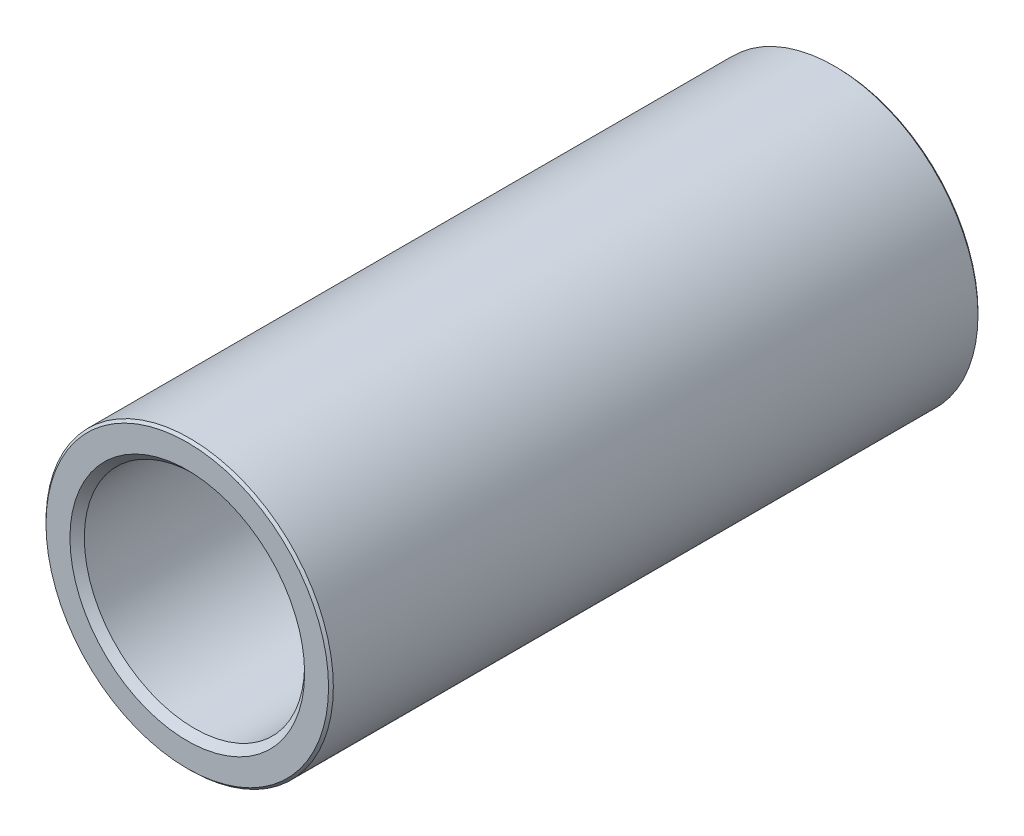
ISO-10303-21;
HEADER;
FILE_DESCRIPTION(('STEP AP214'),'2;1');
FILE_NAME('part.step','',(''),(''),'','','');
FILE_SCHEMA(('AUTOMOTIVE_DESIGN { 1 0 10303 214 1 1 1 1 }'));
ENDSEC;
DATA;
#1=APPLICATION_CONTEXT('core data for automotive mechanical design processes');
#2=APPLICATION_PROTOCOL_DEFINITION('international standard','automotive_design',2000,#1);
#3=PRODUCT_CONTEXT('',#1,'mechanical');
#4=PRODUCT('Part','Part','',(#3));
#5=PRODUCT_RELATED_PRODUCT_CATEGORY('part','',(#4));
#6=PRODUCT_DEFINITION_FORMATION('','',#4);
#7=PRODUCT_DEFINITION_CONTEXT('part definition',#1,'design');
#8=PRODUCT_DEFINITION('design','',#6,#7);
#9=PRODUCT_DEFINITION_SHAPE('','',#8);
#10=(LENGTH_UNIT() NAMED_UNIT(*) SI_UNIT(.MILLI.,.METRE.));
#11=(NAMED_UNIT(*) PLANE_ANGLE_UNIT() SI_UNIT($,.RADIAN.));
#12=(NAMED_UNIT(*) SI_UNIT($,.STERADIAN.) SOLID_ANGLE_UNIT());
#13=UNCERTAINTY_MEASURE_WITH_UNIT(LENGTH_MEASURE(1.E-05),#10,'distance_accuracy_value','');
#14=(GEOMETRIC_REPRESENTATION_CONTEXT(3) GLOBAL_UNCERTAINTY_ASSIGNED_CONTEXT((#13)) GLOBAL_UNIT_ASSIGNED_CONTEXT((#10,
#11,#12)) REPRESENTATION_CONTEXT('',''));
#15=CARTESIAN_POINT('',(0.,0.,0.));
#16=DIRECTION('',(0.,0.,1.));
#17=DIRECTION('',(1.,0.,0.));
#18=AXIS2_PLACEMENT_3D('',#15,#16,#17);
#19=CARTESIAN_POINT('',(0.,0.,67.8072));
#20=DIRECTION('',(0.,0.,1.));
#21=DIRECTION('',(1.,0.,0.));
#22=AXIS2_PLACEMENT_3D('',#19,#20,#21);
#23=PLANE('',#22);
#24=CARTESIAN_POINT('',(0.,0.,67.8072));
#25=DIRECTION('',(0.,0.,1.));
#26=DIRECTION('',(1.,0.,0.));
#27=AXIS2_PLACEMENT_3D('',#24,#25,#26);
#28=CIRCLE('',#27,12.25);
#29=CARTESIAN_POINT('',(12.25,0.,67.8072));
#30=VERTEX_POINT('',#29);
#31=EDGE_CURVE('E40',#30,#30,#28,.F.);
#32=ORIENTED_EDGE('',*,*,#31,.T.);
#33=EDGE_LOOP('',(#32));
#34=FACE_BOUND('',#33,.T.);
#35=CARTESIAN_POINT('',(0.,0.,67.8072));
#36=DIRECTION('',(0.,0.,1.));
#37=DIRECTION('',(1.,0.,0.));
#38=AXIS2_PLACEMENT_3D('',#35,#36,#37);
#39=CIRCLE('',#38,14.75);
#40=CARTESIAN_POINT('',(14.75,0.,67.8072));
#41=VERTEX_POINT('',#40);
#42=EDGE_CURVE('E53',#41,#41,#39,.T.);
#43=ORIENTED_EDGE('',*,*,#42,.T.);
#44=EDGE_LOOP('',(#43));
#45=FACE_BOUND('',#44,.T.);
#46=ADVANCED_FACE('F33',(#34,#45),#23,.T.);
#47=CARTESIAN_POINT('',(0.,0.,0.));
#48=DIRECTION('',(0.,0.,1.));
#49=DIRECTION('',(1.,0.,0.));
#50=AXIS2_PLACEMENT_3D('',#47,#48,#49);
#51=PLANE('',#50);
#52=CARTESIAN_POINT('',(0.,0.,0.));
#53=DIRECTION('',(0.,0.,1.));
#54=DIRECTION('',(1.,0.,0.));
#55=AXIS2_PLACEMENT_3D('',#52,#53,#54);
#56=CIRCLE('',#55,12.25);
#57=CARTESIAN_POINT('',(12.25,0.,0.));
#58=VERTEX_POINT('',#57);
#59=EDGE_CURVE('E10',#58,#58,#56,.T.);
#60=ORIENTED_EDGE('',*,*,#59,.T.);
#61=EDGE_LOOP('',(#60));
#62=FACE_BOUND('',#61,.T.);
#63=CARTESIAN_POINT('',(0.,0.,0.));
#64=DIRECTION('',(0.,0.,1.));
#65=DIRECTION('',(1.,0.,0.));
#66=AXIS2_PLACEMENT_3D('',#63,#64,#65);
#67=CIRCLE('',#66,14.75);
#68=CARTESIAN_POINT('',(14.75,0.,0.));
#69=VERTEX_POINT('',#68);
#70=EDGE_CURVE('E56',#69,#69,#67,.F.);
#71=ORIENTED_EDGE('',*,*,#70,.T.);
#72=EDGE_LOOP('',(#71));
#73=FACE_BOUND('',#72,.T.);
#74=ADVANCED_FACE('F77',(#62,#73),#51,.F.);
#75=CARTESIAN_POINT('',(0.,0.,67.8072));
#76=DIRECTION('',(0.,0.,-1.));
#77=DIRECTION('',(-1.,0.,0.));
#78=AXIS2_PLACEMENT_3D('',#75,#76,#77);
#79=CYLINDRICAL_SURFACE('',#78,15.);
#80=CARTESIAN_POINT('',(0.,0.,0.25));
#81=DIRECTION('',(0.,0.,1.));
#82=DIRECTION('',(1.,0.,0.));
#83=AXIS2_PLACEMENT_3D('',#80,#81,#82);
#84=CIRCLE('',#83,15.);
#85=CARTESIAN_POINT('',(15.,0.,0.25));
#86=VERTEX_POINT('',#85);
#87=EDGE_CURVE('E59',#86,#86,#84,.T.);
#88=ORIENTED_EDGE('',*,*,#87,.T.);
#89=EDGE_LOOP('',(#88));
#90=FACE_BOUND('',#89,.T.);
#91=CARTESIAN_POINT('',(0.,0.,67.5572));
#92=DIRECTION('',(0.,0.,1.));
#93=DIRECTION('',(1.,0.,0.));
#94=AXIS2_PLACEMENT_3D('',#91,#92,#93);
#95=CIRCLE('',#94,15.);
#96=CARTESIAN_POINT('',(15.,0.,67.5572));
#97=VERTEX_POINT('',#96);
#98=EDGE_CURVE('E62',#97,#97,#95,.F.);
#99=ORIENTED_EDGE('',*,*,#98,.T.);
#100=EDGE_LOOP('',(#99));
#101=FACE_BOUND('',#100,.T.);
#102=ADVANCED_FACE('F66',(#90,#101),#79,.T.);
#103=CARTESIAN_POINT('',(0.,0.,67.8072));
#104=DIRECTION('',(0.,0.,-1.));
#105=DIRECTION('',(-1.,0.,0.));
#106=AXIS2_PLACEMENT_3D('',#103,#104,#105);
#107=CYLINDRICAL_SURFACE('',#106,11.5);
#108=CARTESIAN_POINT('',(0.,0.,67.0572));
#109=DIRECTION('',(0.,0.,1.));
#110=DIRECTION('',(1.,0.,0.));
#111=AXIS2_PLACEMENT_3D('',#108,#109,#110);
#112=CIRCLE('',#111,11.5);
#113=CARTESIAN_POINT('',(11.5,0.,67.0572));
#114=VERTEX_POINT('',#113);
#115=EDGE_CURVE('E44',#114,#114,#112,.T.);
#116=ORIENTED_EDGE('',*,*,#115,.T.);
#117=EDGE_LOOP('',(#116));
#118=FACE_BOUND('',#117,.T.);
#119=CARTESIAN_POINT('',(0.,0.,0.750000000000001));
#120=DIRECTION('',(0.,0.,1.));
#121=DIRECTION('',(1.,0.,0.));
#122=AXIS2_PLACEMENT_3D('',#119,#120,#121);
#123=CIRCLE('',#122,11.5);
#124=CARTESIAN_POINT('',(11.5,0.,0.750000000000001));
#125=VERTEX_POINT('',#124);
#126=EDGE_CURVE('E48',#125,#125,#123,.F.);
#127=ORIENTED_EDGE('',*,*,#126,.T.);
#128=EDGE_LOOP('',(#127));
#129=FACE_BOUND('',#128,.T.);
#130=ADVANCED_FACE('F84',(#118,#129),#107,.F.);
#131=CARTESIAN_POINT('',(0.,0.,0.25));
#132=DIRECTION('',(0.,0.,1.));
#133=DIRECTION('',(1.,0.,0.));
#134=AXIS2_PLACEMENT_3D('',#131,#132,#133);
#135=CONICAL_SURFACE('',#134,15.,0.785398163397445);
#136=ORIENTED_EDGE('',*,*,#70,.F.);
#137=EDGE_LOOP('',(#136));
#138=FACE_BOUND('',#137,.T.);
#139=ORIENTED_EDGE('',*,*,#87,.F.);
#140=EDGE_LOOP('',(#139));
#141=FACE_BOUND('',#140,.T.);
#142=ADVANCED_FACE('F72',(#138,#141),#135,.T.);
#143=CARTESIAN_POINT('',(0.,0.,67.8072));
#144=DIRECTION('',(0.,0.,-1.));
#145=DIRECTION('',(-1.,0.,0.));
#146=AXIS2_PLACEMENT_3D('',#143,#144,#145);
#147=CONICAL_SURFACE('',#146,14.75,0.785398163397462);
#148=ORIENTED_EDGE('',*,*,#98,.F.);
#149=EDGE_LOOP('',(#148));
#150=FACE_BOUND('',#149,.T.);
#151=ORIENTED_EDGE('',*,*,#42,.F.);
#152=EDGE_LOOP('',(#151));
#153=FACE_BOUND('',#152,.T.);
#154=ADVANCED_FACE('F68',(#150,#153),#147,.T.);
#155=CARTESIAN_POINT('',(0.,0.,67.0572));
#156=DIRECTION('',(0.,0.,1.));
#157=DIRECTION('',(1.,0.,0.));
#158=AXIS2_PLACEMENT_3D('',#155,#156,#157);
#159=CONICAL_SURFACE('',#158,11.5,0.785398163397441);
#160=ORIENTED_EDGE('',*,*,#31,.F.);
#161=EDGE_LOOP('',(#160));
#162=FACE_BOUND('',#161,.T.);
#163=ORIENTED_EDGE('',*,*,#115,.F.);
#164=EDGE_LOOP('',(#163));
#165=FACE_BOUND('',#164,.T.);
#166=ADVANCED_FACE('F71',(#162,#165),#159,.F.);
#167=CARTESIAN_POINT('',(0.,0.,0.));
#168=DIRECTION('',(0.,0.,-1.));
#169=DIRECTION('',(-1.,0.,0.));
#170=AXIS2_PLACEMENT_3D('',#167,#168,#169);
#171=CONICAL_SURFACE('',#170,12.25,0.785398163397447);
#172=ORIENTED_EDGE('',*,*,#126,.F.);
#173=EDGE_LOOP('',(#172));
#174=FACE_BOUND('',#173,.T.);
#175=ORIENTED_EDGE('',*,*,#59,.F.);
#176=EDGE_LOOP('',(#175));
#177=FACE_BOUND('',#176,.T.);
#178=ADVANCED_FACE('F35',(#174,#177),#171,.F.);
#179=CLOSED_SHELL('',(#46,#74,#102,#130,#142,#154,#166,#178));
#180=MANIFOLD_SOLID_BREP('B2',#179);
#181=ADVANCED_BREP_SHAPE_REPRESENTATION('',(#18,#180),#14);
#182=SHAPE_DEFINITION_REPRESENTATION(#9,#181);
ENDSEC;
END-ISO-10303-21;
